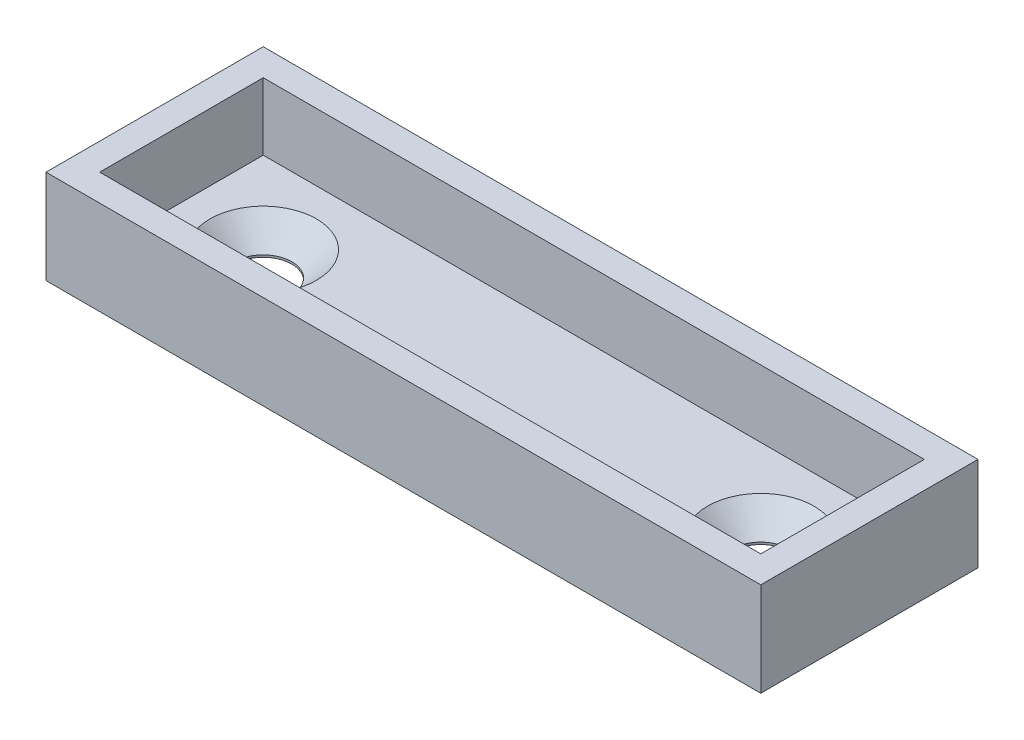
ISO-10303-21;
HEADER;
FILE_DESCRIPTION(('STEP AP214'),'2;1');
FILE_NAME('part.step','',(''),(''),'','','');
FILE_SCHEMA(('AUTOMOTIVE_DESIGN { 1 0 10303 214 1 1 1 1 }'));
ENDSEC;
DATA;
#1=APPLICATION_CONTEXT('core data for automotive mechanical design processes');
#2=APPLICATION_PROTOCOL_DEFINITION('international standard','automotive_design',2000,#1);
#3=PRODUCT_CONTEXT('',#1,'mechanical');
#4=PRODUCT('Part','Part','',(#3));
#5=PRODUCT_RELATED_PRODUCT_CATEGORY('part','',(#4));
#6=PRODUCT_DEFINITION_FORMATION('','',#4);
#7=PRODUCT_DEFINITION_CONTEXT('part definition',#1,'design');
#8=PRODUCT_DEFINITION('design','',#6,#7);
#9=PRODUCT_DEFINITION_SHAPE('','',#8);
#10=(LENGTH_UNIT() NAMED_UNIT(*) SI_UNIT(.MILLI.,.METRE.));
#11=(NAMED_UNIT(*) PLANE_ANGLE_UNIT() SI_UNIT($,.RADIAN.));
#12=(NAMED_UNIT(*) SI_UNIT($,.STERADIAN.) SOLID_ANGLE_UNIT());
#13=UNCERTAINTY_MEASURE_WITH_UNIT(LENGTH_MEASURE(1.E-05),#10,'distance_accuracy_value','');
#14=(GEOMETRIC_REPRESENTATION_CONTEXT(3) GLOBAL_UNCERTAINTY_ASSIGNED_CONTEXT((#13)) GLOBAL_UNIT_ASSIGNED_CONTEXT((#10,
#11,#12)) REPRESENTATION_CONTEXT('',''));
#15=CARTESIAN_POINT('',(0.,0.,0.));
#16=DIRECTION('',(0.,0.,1.));
#17=DIRECTION('',(1.,0.,0.));
#18=AXIS2_PLACEMENT_3D('',#15,#16,#17);
#19=CARTESIAN_POINT('',(18.542,0.,0.));
#20=DIRECTION('',(0.,1.,0.));
#21=DIRECTION('',(0.,0.,1.));
#22=AXIS2_PLACEMENT_3D('',#19,#20,#21);
#23=CYLINDRICAL_SURFACE('',#22,2.12725);
#24=CARTESIAN_POINT('',(18.542,0.,0.));
#25=DIRECTION('',(0.,-1.,0.));
#26=DIRECTION('',(0.,0.,1.));
#27=AXIS2_PLACEMENT_3D('',#24,#25,#26);
#28=CIRCLE('',#27,2.12725);
#29=CARTESIAN_POINT('',(18.542,0.,2.12725));
#30=VERTEX_POINT('',#29);
#31=EDGE_CURVE('E253',#30,#30,#28,.T.);
#32=ORIENTED_EDGE('',*,*,#31,.T.);
#33=EDGE_LOOP('',(#32));
#34=FACE_BOUND('',#33,.T.);
#35=CARTESIAN_POINT('',(18.542,0.158499999999956,0.));
#36=DIRECTION('',(0.,1.,0.));
#37=DIRECTION('',(-1.,0.,0.));
#38=AXIS2_PLACEMENT_3D('',#35,#36,#37);
#39=CIRCLE('',#38,2.12725);
#40=CARTESIAN_POINT('',(16.41475,0.158499999999971,0.));
#41=VERTEX_POINT('',#40);
#42=EDGE_CURVE('E45',#41,#41,#39,.T.);
#43=ORIENTED_EDGE('',*,*,#42,.T.);
#44=EDGE_LOOP('',(#43));
#45=FACE_BOUND('',#44,.T.);
#46=ADVANCED_FACE('F41',(#34,#45),#23,.F.);
#47=CARTESIAN_POINT('',(-18.542,0.,0.));
#48=DIRECTION('',(0.,1.,0.));
#49=DIRECTION('',(0.,0.,1.));
#50=AXIS2_PLACEMENT_3D('',#47,#48,#49);
#51=CYLINDRICAL_SURFACE('',#50,2.12725);
#52=CARTESIAN_POINT('',(-18.542,0.,0.));
#53=DIRECTION('',(0.,1.,0.));
#54=DIRECTION('',(0.,0.,1.));
#55=AXIS2_PLACEMENT_3D('',#52,#53,#54);
#56=CIRCLE('',#55,2.12725);
#57=CARTESIAN_POINT('',(-18.542,0.,2.12725));
#58=VERTEX_POINT('',#57);
#59=EDGE_CURVE('E262',#58,#58,#56,.T.);
#60=ORIENTED_EDGE('',*,*,#59,.F.);
#61=EDGE_LOOP('',(#60));
#62=FACE_BOUND('',#61,.T.);
#63=CARTESIAN_POINT('',(-18.542,0.158499999999956,0.));
#64=DIRECTION('',(0.,1.,0.));
#65=DIRECTION('',(-1.,0.,0.));
#66=AXIS2_PLACEMENT_3D('',#63,#64,#65);
#67=CIRCLE('',#66,2.12725);
#68=CARTESIAN_POINT('',(-20.66925,0.158499999999941,0.));
#69=VERTEX_POINT('',#68);
#70=EDGE_CURVE('E261',#69,#69,#67,.F.);
#71=ORIENTED_EDGE('',*,*,#70,.F.);
#72=EDGE_LOOP('',(#71));
#73=FACE_BOUND('',#72,.T.);
#74=ADVANCED_FACE('F353',(#62,#73),#51,.F.);
#75=CARTESIAN_POINT('',(0.,2.,0.));
#76=DIRECTION('',(0.,-1.,0.));
#77=DIRECTION('',(0.,0.,-1.));
#78=AXIS2_PLACEMENT_3D('',#75,#76,#77);
#79=PLANE('',#78);
#80=CARTESIAN_POINT('',(18.542,1.99999999999997,0.));
#81=DIRECTION('',(0.,1.,0.));
#82=DIRECTION('',(-1.,0.,0.));
#83=AXIS2_PLACEMENT_3D('',#80,#81,#82);
#84=CIRCLE('',#83,3.96874999999999);
#85=CARTESIAN_POINT('',(14.57325,2.,0.));
#86=VERTEX_POINT('',#85);
#87=EDGE_CURVE('E203',#86,#86,#84,.T.);
#88=ORIENTED_EDGE('',*,*,#87,.F.);
#89=EDGE_LOOP('',(#88));
#90=FACE_BOUND('',#89,.T.);
#91=CARTESIAN_POINT('',(-18.542,1.99999999999997,0.));
#92=DIRECTION('',(0.,-1.,0.));
#93=DIRECTION('',(1.,0.,0.));
#94=AXIS2_PLACEMENT_3D('',#91,#92,#93);
#95=CIRCLE('',#94,3.96874999999999);
#96=CARTESIAN_POINT('',(-14.57325,2.,0.));
#97=VERTEX_POINT('',#96);
#98=EDGE_CURVE('E257',#97,#97,#95,.T.);
#99=ORIENTED_EDGE('',*,*,#98,.T.);
#100=EDGE_LOOP('',(#99));
#101=FACE_BOUND('',#100,.T.);
#102=DIRECTION('',(0.,0.,-1.));
#103=VECTOR('',#102,1.);
#104=CARTESIAN_POINT('',(24.638,2.,6.096));
#105=LINE('',#104,#103);
#106=CARTESIAN_POINT('',(24.638,2.,6.096));
#107=VERTEX_POINT('',#106);
#108=CARTESIAN_POINT('',(24.638,2.,-6.096));
#109=VERTEX_POINT('',#108);
#110=EDGE_CURVE('E335',#107,#109,#105,.T.);
#111=ORIENTED_EDGE('',*,*,#110,.T.);
#112=DIRECTION('',(-1.,0.,0.));
#113=VECTOR('',#112,1.);
#114=CARTESIAN_POINT('',(-24.638,2.,-6.096));
#115=LINE('',#114,#113);
#116=CARTESIAN_POINT('',(-24.638,2.,-6.096));
#117=VERTEX_POINT('',#116);
#118=EDGE_CURVE('E341',#109,#117,#115,.T.);
#119=ORIENTED_EDGE('',*,*,#118,.T.);
#120=DIRECTION('',(0.,0.,1.));
#121=VECTOR('',#120,1.);
#122=CARTESIAN_POINT('',(-24.638,2.,6.096));
#123=LINE('',#122,#121);
#124=CARTESIAN_POINT('',(-24.638,2.,6.096));
#125=VERTEX_POINT('',#124);
#126=EDGE_CURVE('E51',#117,#125,#123,.T.);
#127=ORIENTED_EDGE('',*,*,#126,.T.);
#128=DIRECTION('',(1.,0.,0.));
#129=VECTOR('',#128,1.);
#130=CARTESIAN_POINT('',(-24.638,2.,6.096));
#131=LINE('',#130,#129);
#132=EDGE_CURVE('E12',#125,#107,#131,.T.);
#133=ORIENTED_EDGE('',*,*,#132,.T.);
#134=EDGE_LOOP('',(#111,#119,#127,#133));
#135=FACE_BOUND('',#134,.T.);
#136=ADVANCED_FACE('F355',(#90,#101,#135),#79,.F.);
#137=CARTESIAN_POINT('',(-24.638,67.682250672903,6.096));
#138=DIRECTION('',(0.,0.,-1.));
#139=DIRECTION('',(-1.,0.,0.));
#140=AXIS2_PLACEMENT_3D('',#137,#138,#139);
#141=PLANE('',#140);
#142=ORIENTED_EDGE('',*,*,#132,.F.);
#143=DIRECTION('',(0.,-1.,0.));
#144=VECTOR('',#143,1.);
#145=CARTESIAN_POINT('',(-24.638,67.682250672903,6.096));
#146=LINE('',#145,#144);
#147=CARTESIAN_POINT('',(-24.638,7.,6.096));
#148=VERTEX_POINT('',#147);
#149=EDGE_CURVE('E315',#148,#125,#146,.T.);
#150=ORIENTED_EDGE('',*,*,#149,.F.);
#151=DIRECTION('',(-1.,0.,0.));
#152=VECTOR('',#151,1.);
#153=CARTESIAN_POINT('',(-24.638,7.,6.096));
#154=LINE('',#153,#152);
#155=CARTESIAN_POINT('',(24.638,7.,6.096));
#156=VERTEX_POINT('',#155);
#157=EDGE_CURVE('E295',#156,#148,#154,.T.);
#158=ORIENTED_EDGE('',*,*,#157,.F.);
#159=DIRECTION('',(0.,-1.,0.));
#160=VECTOR('',#159,1.);
#161=CARTESIAN_POINT('',(24.638,67.682250672903,6.096));
#162=LINE('',#161,#160);
#163=EDGE_CURVE('E271',#156,#107,#162,.T.);
#164=ORIENTED_EDGE('',*,*,#163,.T.);
#165=EDGE_LOOP('',(#142,#150,#158,#164));
#166=FACE_BOUND('',#165,.T.);
#167=ADVANCED_FACE('F362',(#166),#141,.T.);
#168=CARTESIAN_POINT('',(24.638,67.682250672903,6.096));
#169=DIRECTION('',(-1.,0.,0.));
#170=DIRECTION('',(0.,0.,1.));
#171=AXIS2_PLACEMENT_3D('',#168,#169,#170);
#172=PLANE('',#171);
#173=ORIENTED_EDGE('',*,*,#110,.F.);
#174=ORIENTED_EDGE('',*,*,#163,.F.);
#175=DIRECTION('',(0.,0.,1.));
#176=VECTOR('',#175,1.);
#177=CARTESIAN_POINT('',(24.638,7.,6.096));
#178=LINE('',#177,#176);
#179=CARTESIAN_POINT('',(24.638,7.,-6.096));
#180=VERTEX_POINT('',#179);
#181=EDGE_CURVE('E332',#180,#156,#178,.T.);
#182=ORIENTED_EDGE('',*,*,#181,.F.);
#183=DIRECTION('',(0.,-1.,0.));
#184=VECTOR('',#183,1.);
#185=CARTESIAN_POINT('',(24.638,67.682250672903,-6.096));
#186=LINE('',#185,#184);
#187=EDGE_CURVE('E307',#180,#109,#186,.T.);
#188=ORIENTED_EDGE('',*,*,#187,.T.);
#189=EDGE_LOOP('',(#173,#174,#182,#188));
#190=FACE_BOUND('',#189,.T.);
#191=ADVANCED_FACE('F393',(#190),#172,.T.);
#192=CARTESIAN_POINT('',(24.638,67.682250672903,-6.096));
#193=DIRECTION('',(0.,0.,1.));
#194=DIRECTION('',(1.,0.,0.));
#195=AXIS2_PLACEMENT_3D('',#192,#193,#194);
#196=PLANE('',#195);
#197=ORIENTED_EDGE('',*,*,#118,.F.);
#198=ORIENTED_EDGE('',*,*,#187,.F.);
#199=DIRECTION('',(1.,0.,0.));
#200=VECTOR('',#199,1.);
#201=CARTESIAN_POINT('',(24.638,7.,-6.096));
#202=LINE('',#201,#200);
#203=CARTESIAN_POINT('',(-24.638,7.,-6.096));
#204=VERTEX_POINT('',#203);
#205=EDGE_CURVE('E294',#204,#180,#202,.T.);
#206=ORIENTED_EDGE('',*,*,#205,.F.);
#207=DIRECTION('',(0.,-1.,0.));
#208=VECTOR('',#207,1.);
#209=CARTESIAN_POINT('',(-24.638,67.682250672903,-6.096));
#210=LINE('',#209,#208);
#211=EDGE_CURVE('E311',#204,#117,#210,.T.);
#212=ORIENTED_EDGE('',*,*,#211,.T.);
#213=EDGE_LOOP('',(#197,#198,#206,#212));
#214=FACE_BOUND('',#213,.T.);
#215=ADVANCED_FACE('F389',(#214),#196,.T.);
#216=CARTESIAN_POINT('',(-24.638,67.682250672903,-6.096));
#217=DIRECTION('',(1.,0.,0.));
#218=DIRECTION('',(0.,0.,-1.));
#219=AXIS2_PLACEMENT_3D('',#216,#217,#218);
#220=PLANE('',#219);
#221=ORIENTED_EDGE('',*,*,#126,.F.);
#222=ORIENTED_EDGE('',*,*,#211,.F.);
#223=DIRECTION('',(0.,0.,-1.));
#224=VECTOR('',#223,1.);
#225=CARTESIAN_POINT('',(-24.638,7.,-6.096));
#226=LINE('',#225,#224);
#227=EDGE_CURVE('E291',#148,#204,#226,.T.);
#228=ORIENTED_EDGE('',*,*,#227,.F.);
#229=ORIENTED_EDGE('',*,*,#149,.T.);
#230=EDGE_LOOP('',(#221,#222,#228,#229));
#231=FACE_BOUND('',#230,.T.);
#232=ADVANCED_FACE('F385',(#231),#220,.T.);
#233=CARTESIAN_POINT('',(26.638,67.682250672903,8.096));
#234=DIRECTION('',(-1.,0.,0.));
#235=DIRECTION('',(0.,0.,1.));
#236=AXIS2_PLACEMENT_3D('',#233,#234,#235);
#237=PLANE('',#236);
#238=DIRECTION('',(0.,-1.,0.));
#239=VECTOR('',#238,1.);
#240=CARTESIAN_POINT('',(26.638,67.682250672903,-8.096));
#241=LINE('',#240,#239);
#242=CARTESIAN_POINT('',(26.638,7.,-8.096));
#243=VERTEX_POINT('',#242);
#244=CARTESIAN_POINT('',(26.638,0.,-8.096));
#245=VERTEX_POINT('',#244);
#246=EDGE_CURVE('E284',#243,#245,#241,.T.);
#247=ORIENTED_EDGE('',*,*,#246,.F.);
#248=DIRECTION('',(0.,0.,1.));
#249=VECTOR('',#248,1.);
#250=CARTESIAN_POINT('',(26.638,7.,8.096));
#251=LINE('',#250,#249);
#252=CARTESIAN_POINT('',(26.638,7.,8.096));
#253=VERTEX_POINT('',#252);
#254=EDGE_CURVE('E266',#243,#253,#251,.T.);
#255=ORIENTED_EDGE('',*,*,#254,.T.);
#256=DIRECTION('',(0.,-1.,0.));
#257=VECTOR('',#256,1.);
#258=CARTESIAN_POINT('',(26.638,67.682250672903,8.096));
#259=LINE('',#258,#257);
#260=CARTESIAN_POINT('',(26.638,0.,8.096));
#261=VERTEX_POINT('',#260);
#262=EDGE_CURVE('E290',#253,#261,#259,.T.);
#263=ORIENTED_EDGE('',*,*,#262,.T.);
#264=DIRECTION('',(0.,0.,-1.));
#265=VECTOR('',#264,1.);
#266=CARTESIAN_POINT('',(26.638,0.,8.096));
#267=LINE('',#266,#265);
#268=EDGE_CURVE('E285',#261,#245,#267,.T.);
#269=ORIENTED_EDGE('',*,*,#268,.T.);
#270=EDGE_LOOP('',(#247,#255,#263,#269));
#271=FACE_BOUND('',#270,.T.);
#272=ADVANCED_FACE('F381',(#271),#237,.F.);
#273=CARTESIAN_POINT('',(-26.638,67.682250672903,-8.096));
#274=DIRECTION('',(0.,0.,1.));
#275=DIRECTION('',(1.,0.,0.));
#276=AXIS2_PLACEMENT_3D('',#273,#274,#275);
#277=PLANE('',#276);
#278=DIRECTION('',(0.,-1.,0.));
#279=VECTOR('',#278,1.);
#280=CARTESIAN_POINT('',(-26.638,67.682250672903,-8.096));
#281=LINE('',#280,#279);
#282=CARTESIAN_POINT('',(-26.638,7.,-8.096));
#283=VERTEX_POINT('',#282);
#284=CARTESIAN_POINT('',(-26.638,0.,-8.096));
#285=VERTEX_POINT('',#284);
#286=EDGE_CURVE('E278',#283,#285,#281,.T.);
#287=ORIENTED_EDGE('',*,*,#286,.F.);
#288=DIRECTION('',(1.,0.,0.));
#289=VECTOR('',#288,1.);
#290=CARTESIAN_POINT('',(-26.638,7.,-8.096));
#291=LINE('',#290,#289);
#292=EDGE_CURVE('E289',#283,#243,#291,.T.);
#293=ORIENTED_EDGE('',*,*,#292,.T.);
#294=ORIENTED_EDGE('',*,*,#246,.T.);
#295=DIRECTION('',(-1.,0.,0.));
#296=VECTOR('',#295,1.);
#297=CARTESIAN_POINT('',(-26.638,0.,-8.096));
#298=LINE('',#297,#296);
#299=EDGE_CURVE('E279',#245,#285,#298,.T.);
#300=ORIENTED_EDGE('',*,*,#299,.T.);
#301=EDGE_LOOP('',(#287,#293,#294,#300));
#302=FACE_BOUND('',#301,.T.);
#303=ADVANCED_FACE('F377',(#302),#277,.F.);
#304=CARTESIAN_POINT('',(-26.638,67.682250672903,8.096));
#305=DIRECTION('',(1.,0.,0.));
#306=DIRECTION('',(0.,0.,-1.));
#307=AXIS2_PLACEMENT_3D('',#304,#305,#306);
#308=PLANE('',#307);
#309=DIRECTION('',(0.,-1.,0.));
#310=VECTOR('',#309,1.);
#311=CARTESIAN_POINT('',(-26.638,67.682250672903,8.096));
#312=LINE('',#311,#310);
#313=CARTESIAN_POINT('',(-26.638,7.,8.096));
#314=VERTEX_POINT('',#313);
#315=CARTESIAN_POINT('',(-26.638,0.,8.096));
#316=VERTEX_POINT('',#315);
#317=EDGE_CURVE('E272',#314,#316,#312,.T.);
#318=ORIENTED_EDGE('',*,*,#317,.F.);
#319=DIRECTION('',(0.,0.,-1.));
#320=VECTOR('',#319,1.);
#321=CARTESIAN_POINT('',(-26.638,7.,8.096));
#322=LINE('',#321,#320);
#323=EDGE_CURVE('E283',#314,#283,#322,.T.);
#324=ORIENTED_EDGE('',*,*,#323,.T.);
#325=ORIENTED_EDGE('',*,*,#286,.T.);
#326=DIRECTION('',(0.,0.,1.));
#327=VECTOR('',#326,1.);
#328=CARTESIAN_POINT('',(-26.638,0.,8.096));
#329=LINE('',#328,#327);
#330=EDGE_CURVE('E273',#285,#316,#329,.T.);
#331=ORIENTED_EDGE('',*,*,#330,.T.);
#332=EDGE_LOOP('',(#318,#324,#325,#331));
#333=FACE_BOUND('',#332,.T.);
#334=ADVANCED_FACE('F373',(#333),#308,.F.);
#335=CARTESIAN_POINT('',(-26.638,67.682250672903,8.096));
#336=DIRECTION('',(0.,0.,-1.));
#337=DIRECTION('',(-1.,0.,0.));
#338=AXIS2_PLACEMENT_3D('',#335,#336,#337);
#339=PLANE('',#338);
#340=ORIENTED_EDGE('',*,*,#262,.F.);
#341=DIRECTION('',(-1.,0.,0.));
#342=VECTOR('',#341,1.);
#343=CARTESIAN_POINT('',(-26.638,7.,8.096));
#344=LINE('',#343,#342);
#345=EDGE_CURVE('E277',#253,#314,#344,.T.);
#346=ORIENTED_EDGE('',*,*,#345,.T.);
#347=ORIENTED_EDGE('',*,*,#317,.T.);
#348=DIRECTION('',(1.,0.,0.));
#349=VECTOR('',#348,1.);
#350=CARTESIAN_POINT('',(-26.638,0.,8.096));
#351=LINE('',#350,#349);
#352=EDGE_CURVE('E267',#316,#261,#351,.T.);
#353=ORIENTED_EDGE('',*,*,#352,.T.);
#354=EDGE_LOOP('',(#340,#346,#347,#353));
#355=FACE_BOUND('',#354,.T.);
#356=ADVANCED_FACE('F369',(#355),#339,.F.);
#357=CARTESIAN_POINT('',(0.,7.,0.));
#358=DIRECTION('',(0.,-1.,0.));
#359=DIRECTION('',(0.,0.,-1.));
#360=AXIS2_PLACEMENT_3D('',#357,#358,#359);
#361=PLANE('',#360);
#362=ORIENTED_EDGE('',*,*,#157,.T.);
#363=ORIENTED_EDGE('',*,*,#227,.T.);
#364=ORIENTED_EDGE('',*,*,#205,.T.);
#365=ORIENTED_EDGE('',*,*,#181,.T.);
#366=EDGE_LOOP('',(#362,#363,#364,#365));
#367=FACE_BOUND('',#366,.T.);
#368=ORIENTED_EDGE('',*,*,#292,.F.);
#369=ORIENTED_EDGE('',*,*,#323,.F.);
#370=ORIENTED_EDGE('',*,*,#345,.F.);
#371=ORIENTED_EDGE('',*,*,#254,.F.);
#372=EDGE_LOOP('',(#368,#369,#370,#371));
#373=FACE_BOUND('',#372,.T.);
#374=ADVANCED_FACE('F372',(#367,#373),#361,.F.);
#375=CARTESIAN_POINT('',(0.,0.,0.));
#376=DIRECTION('',(0.,-1.,0.));
#377=DIRECTION('',(0.,0.,-1.));
#378=AXIS2_PLACEMENT_3D('',#375,#376,#377);
#379=PLANE('',#378);
#380=DIRECTION('',(0.,0.,1.));
#381=VECTOR('',#380,1.);
#382=CARTESIAN_POINT('',(12.5,0.,3.846));
#383=LINE('',#382,#381);
#384=CARTESIAN_POINT('',(12.5,0.,3.846));
#385=VERTEX_POINT('',#384);
#386=CARTESIAN_POINT('',(12.5,0.,7.096));
#387=VERTEX_POINT('',#386);
#388=EDGE_CURVE('E59',#385,#387,#383,.T.);
#389=ORIENTED_EDGE('',*,*,#388,.F.);
#390=DIRECTION('',(1.,0.,0.));
#391=VECTOR('',#390,1.);
#392=CARTESIAN_POINT('',(-12.5,0.,3.846));
#393=LINE('',#392,#391);
#394=CARTESIAN_POINT('',(-12.5,0.,3.846));
#395=VERTEX_POINT('',#394);
#396=EDGE_CURVE('E180',#395,#385,#393,.T.);
#397=ORIENTED_EDGE('',*,*,#396,.F.);
#398=DIRECTION('',(0.,0.,-1.));
#399=VECTOR('',#398,1.);
#400=CARTESIAN_POINT('',(-12.5,0.,3.846));
#401=LINE('',#400,#399);
#402=CARTESIAN_POINT('',(-12.5,0.,7.096));
#403=VERTEX_POINT('',#402);
#404=EDGE_CURVE('E184',#403,#395,#401,.T.);
#405=ORIENTED_EDGE('',*,*,#404,.F.);
#406=DIRECTION('',(-1.,0.,0.));
#407=VECTOR('',#406,1.);
#408=CARTESIAN_POINT('',(-12.5,0.,7.096));
#409=LINE('',#408,#407);
#410=EDGE_CURVE('E193',#387,#403,#409,.T.);
#411=ORIENTED_EDGE('',*,*,#410,.F.);
#412=EDGE_LOOP('',(#389,#397,#405,#411));
#413=FACE_BOUND('',#412,.T.);
#414=DIRECTION('',(0.,0.,1.));
#415=VECTOR('',#414,1.);
#416=CARTESIAN_POINT('',(12.5,0.,-7.096));
#417=LINE('',#416,#415);
#418=CARTESIAN_POINT('',(12.5,0.,-7.096));
#419=VERTEX_POINT('',#418);
#420=CARTESIAN_POINT('',(12.5,0.,-3.846));
#421=VERTEX_POINT('',#420);
#422=EDGE_CURVE('E67',#419,#421,#417,.T.);
#423=ORIENTED_EDGE('',*,*,#422,.F.);
#424=DIRECTION('',(1.,0.,0.));
#425=VECTOR('',#424,1.);
#426=CARTESIAN_POINT('',(-12.5,0.,-7.096));
#427=LINE('',#426,#425);
#428=CARTESIAN_POINT('',(-12.5,0.,-7.096));
#429=VERTEX_POINT('',#428);
#430=EDGE_CURVE('E214',#429,#419,#427,.T.);
#431=ORIENTED_EDGE('',*,*,#430,.F.);
#432=DIRECTION('',(0.,0.,-1.));
#433=VECTOR('',#432,1.);
#434=CARTESIAN_POINT('',(-12.5,0.,-7.096));
#435=LINE('',#434,#433);
#436=CARTESIAN_POINT('',(-12.5,0.,-3.846));
#437=VERTEX_POINT('',#436);
#438=EDGE_CURVE('E233',#437,#429,#435,.T.);
#439=ORIENTED_EDGE('',*,*,#438,.F.);
#440=DIRECTION('',(-1.,0.,0.));
#441=VECTOR('',#440,1.);
#442=CARTESIAN_POINT('',(-12.5,0.,-3.846));
#443=LINE('',#442,#441);
#444=EDGE_CURVE('E229',#421,#437,#443,.T.);
#445=ORIENTED_EDGE('',*,*,#444,.F.);
#446=EDGE_LOOP('',(#423,#431,#439,#445));
#447=FACE_BOUND('',#446,.T.);
#448=ORIENTED_EDGE('',*,*,#31,.F.);
#449=EDGE_LOOP('',(#448));
#450=FACE_BOUND('',#449,.T.);
#451=ORIENTED_EDGE('',*,*,#59,.T.);
#452=EDGE_LOOP('',(#451));
#453=FACE_BOUND('',#452,.T.);
#454=ORIENTED_EDGE('',*,*,#268,.F.);
#455=ORIENTED_EDGE('',*,*,#352,.F.);
#456=ORIENTED_EDGE('',*,*,#330,.F.);
#457=ORIENTED_EDGE('',*,*,#299,.F.);
#458=EDGE_LOOP('',(#454,#455,#456,#457));
#459=FACE_BOUND('',#458,.T.);
#460=ADVANCED_FACE('F43',(#413,#447,#450,#453,#459),#379,.T.);
#461=CARTESIAN_POINT('',(-18.542,1.99999999999997,0.));
#462=DIRECTION('',(0.,1.,0.));
#463=DIRECTION('',(-1.,0.,0.));
#464=AXIS2_PLACEMENT_3D('',#461,#462,#463);
#465=CONICAL_SURFACE('',#464,3.96874999999999,0.785398163397441);
#466=ORIENTED_EDGE('',*,*,#98,.F.);
#467=EDGE_LOOP('',(#466));
#468=FACE_BOUND('',#467,.T.);
#469=ORIENTED_EDGE('',*,*,#70,.T.);
#470=EDGE_LOOP('',(#469));
#471=FACE_BOUND('',#470,.T.);
#472=ADVANCED_FACE('F351',(#468,#471),#465,.F.);
#473=CARTESIAN_POINT('',(18.542,1.99999999999997,0.));
#474=DIRECTION('',(0.,1.,0.));
#475=DIRECTION('',(1.,0.,0.));
#476=AXIS2_PLACEMENT_3D('',#473,#474,#475);
#477=CONICAL_SURFACE('',#476,3.96874999999999,0.785398163397441);
#478=ORIENTED_EDGE('',*,*,#42,.F.);
#479=EDGE_LOOP('',(#478));
#480=FACE_BOUND('',#479,.T.);
#481=ORIENTED_EDGE('',*,*,#87,.T.);
#482=EDGE_LOOP('',(#481));
#483=FACE_BOUND('',#482,.T.);
#484=ADVANCED_FACE('F430',(#480,#483),#477,.F.);
#485=CARTESIAN_POINT('',(12.5,0.6,-7.096));
#486=DIRECTION('',(1.,0.,0.));
#487=DIRECTION('',(0.,0.,-1.));
#488=AXIS2_PLACEMENT_3D('',#485,#486,#487);
#489=PLANE('',#488);
#490=ORIENTED_EDGE('',*,*,#422,.T.);
#491=DIRECTION('',(0.,-1.,0.));
#492=VECTOR('',#491,1.);
#493=CARTESIAN_POINT('',(12.5,0.6,-3.846));
#494=LINE('',#493,#492);
#495=CARTESIAN_POINT('',(12.5,0.6,-3.846));
#496=VERTEX_POINT('',#495);
#497=EDGE_CURVE('E226',#496,#421,#494,.T.);
#498=ORIENTED_EDGE('',*,*,#497,.F.);
#499=DIRECTION('',(0.,0.,1.));
#500=VECTOR('',#499,1.);
#501=CARTESIAN_POINT('',(12.5,0.6,-7.096));
#502=LINE('',#501,#500);
#503=CARTESIAN_POINT('',(12.5,0.6,-7.096));
#504=VERTEX_POINT('',#503);
#505=EDGE_CURVE('E209',#504,#496,#502,.T.);
#506=ORIENTED_EDGE('',*,*,#505,.F.);
#507=DIRECTION('',(0.,-1.,0.));
#508=VECTOR('',#507,1.);
#509=CARTESIAN_POINT('',(12.5,0.6,-7.096));
#510=LINE('',#509,#508);
#511=EDGE_CURVE('E194',#504,#419,#510,.T.);
#512=ORIENTED_EDGE('',*,*,#511,.T.);
#513=EDGE_LOOP('',(#490,#498,#506,#512));
#514=FACE_BOUND('',#513,.T.);
#515=ADVANCED_FACE('F446',(#514),#489,.F.);
#516=CARTESIAN_POINT('',(-12.5,0.6,-7.096));
#517=DIRECTION('',(0.,0.,-1.));
#518=DIRECTION('',(-1.,0.,0.));
#519=AXIS2_PLACEMENT_3D('',#516,#517,#518);
#520=PLANE('',#519);
#521=ORIENTED_EDGE('',*,*,#430,.T.);
#522=ORIENTED_EDGE('',*,*,#511,.F.);
#523=DIRECTION('',(1.,0.,0.));
#524=VECTOR('',#523,1.);
#525=CARTESIAN_POINT('',(-12.5,0.6,-7.096));
#526=LINE('',#525,#524);
#527=CARTESIAN_POINT('',(-12.5,0.6,-7.096));
#528=VERTEX_POINT('',#527);
#529=EDGE_CURVE('E222',#528,#504,#526,.T.);
#530=ORIENTED_EDGE('',*,*,#529,.F.);
#531=DIRECTION('',(0.,-1.,0.));
#532=VECTOR('',#531,1.);
#533=CARTESIAN_POINT('',(-12.5,0.6,-7.096));
#534=LINE('',#533,#532);
#535=EDGE_CURVE('E242',#528,#429,#534,.T.);
#536=ORIENTED_EDGE('',*,*,#535,.T.);
#537=EDGE_LOOP('',(#521,#522,#530,#536));
#538=FACE_BOUND('',#537,.T.);
#539=ADVANCED_FACE('F454',(#538),#520,.F.);
#540=CARTESIAN_POINT('',(-12.5,0.6,-7.096));
#541=DIRECTION('',(-1.,0.,0.));
#542=DIRECTION('',(0.,0.,1.));
#543=AXIS2_PLACEMENT_3D('',#540,#541,#542);
#544=PLANE('',#543);
#545=ORIENTED_EDGE('',*,*,#438,.T.);
#546=ORIENTED_EDGE('',*,*,#535,.F.);
#547=DIRECTION('',(0.,0.,-1.));
#548=VECTOR('',#547,1.);
#549=CARTESIAN_POINT('',(-12.5,0.6,-7.096));
#550=LINE('',#549,#548);
#551=CARTESIAN_POINT('',(-12.5,0.6,-3.846));
#552=VERTEX_POINT('',#551);
#553=EDGE_CURVE('E218',#552,#528,#550,.T.);
#554=ORIENTED_EDGE('',*,*,#553,.F.);
#555=DIRECTION('',(0.,-1.,0.));
#556=VECTOR('',#555,1.);
#557=CARTESIAN_POINT('',(-12.5,0.6,-3.846));
#558=LINE('',#557,#556);
#559=EDGE_CURVE('E245',#552,#437,#558,.T.);
#560=ORIENTED_EDGE('',*,*,#559,.T.);
#561=EDGE_LOOP('',(#545,#546,#554,#560));
#562=FACE_BOUND('',#561,.T.);
#563=ADVANCED_FACE('F461',(#562),#544,.F.);
#564=CARTESIAN_POINT('',(-12.5,0.6,-3.846));
#565=DIRECTION('',(0.,0.,1.));
#566=DIRECTION('',(1.,0.,0.));
#567=AXIS2_PLACEMENT_3D('',#564,#565,#566);
#568=PLANE('',#567);
#569=ORIENTED_EDGE('',*,*,#444,.T.);
#570=ORIENTED_EDGE('',*,*,#559,.F.);
#571=DIRECTION('',(-1.,0.,0.));
#572=VECTOR('',#571,1.);
#573=CARTESIAN_POINT('',(-12.5,0.6,-3.846));
#574=LINE('',#573,#572);
#575=EDGE_CURVE('E213',#496,#552,#574,.T.);
#576=ORIENTED_EDGE('',*,*,#575,.F.);
#577=ORIENTED_EDGE('',*,*,#497,.T.);
#578=EDGE_LOOP('',(#569,#570,#576,#577));
#579=FACE_BOUND('',#578,.T.);
#580=ADVANCED_FACE('F457',(#579),#568,.F.);
#581=CARTESIAN_POINT('',(0.,0.6,0.));
#582=DIRECTION('',(0.,1.,0.));
#583=DIRECTION('',(0.,0.,1.));
#584=AXIS2_PLACEMENT_3D('',#581,#582,#583);
#585=PLANE('',#584);
#586=ORIENTED_EDGE('',*,*,#505,.T.);
#587=ORIENTED_EDGE('',*,*,#575,.T.);
#588=ORIENTED_EDGE('',*,*,#553,.T.);
#589=ORIENTED_EDGE('',*,*,#529,.T.);
#590=EDGE_LOOP('',(#586,#587,#588,#589));
#591=FACE_BOUND('',#590,.T.);
#592=ADVANCED_FACE('F460',(#591),#585,.F.);
#593=CARTESIAN_POINT('',(12.5,0.6,3.846));
#594=DIRECTION('',(1.,0.,0.));
#595=DIRECTION('',(0.,0.,-1.));
#596=AXIS2_PLACEMENT_3D('',#593,#594,#595);
#597=PLANE('',#596);
#598=ORIENTED_EDGE('',*,*,#388,.T.);
#599=DIRECTION('',(0.,-1.,0.));
#600=VECTOR('',#599,1.);
#601=CARTESIAN_POINT('',(12.5,0.6,7.096));
#602=LINE('',#601,#600);
#603=CARTESIAN_POINT('',(12.5,0.6,7.096));
#604=VERTEX_POINT('',#603);
#605=EDGE_CURVE('E155',#604,#387,#602,.T.);
#606=ORIENTED_EDGE('',*,*,#605,.F.);
#607=DIRECTION('',(0.,0.,1.));
#608=VECTOR('',#607,1.);
#609=CARTESIAN_POINT('',(12.5,0.6,3.846));
#610=LINE('',#609,#608);
#611=CARTESIAN_POINT('',(12.5,0.6,3.846));
#612=VERTEX_POINT('',#611);
#613=EDGE_CURVE('E159',#612,#604,#610,.T.);
#614=ORIENTED_EDGE('',*,*,#613,.F.);
#615=DIRECTION('',(0.,-1.,0.));
#616=VECTOR('',#615,1.);
#617=CARTESIAN_POINT('',(12.5,0.6,3.846));
#618=LINE('',#617,#616);
#619=EDGE_CURVE('E200',#612,#385,#618,.T.);
#620=ORIENTED_EDGE('',*,*,#619,.T.);
#621=EDGE_LOOP('',(#598,#606,#614,#620));
#622=FACE_BOUND('',#621,.T.);
#623=ADVANCED_FACE('F157',(#622),#597,.F.);
#624=CARTESIAN_POINT('',(-12.5,0.6,3.846));
#625=DIRECTION('',(0.,0.,-1.));
#626=DIRECTION('',(-1.,0.,0.));
#627=AXIS2_PLACEMENT_3D('',#624,#625,#626);
#628=PLANE('',#627);
#629=ORIENTED_EDGE('',*,*,#396,.T.);
#630=ORIENTED_EDGE('',*,*,#619,.F.);
#631=DIRECTION('',(1.,0.,0.));
#632=VECTOR('',#631,1.);
#633=CARTESIAN_POINT('',(-12.5,0.6,3.846));
#634=LINE('',#633,#632);
#635=CARTESIAN_POINT('',(-12.5,0.6,3.846));
#636=VERTEX_POINT('',#635);
#637=EDGE_CURVE('E166',#636,#612,#634,.T.);
#638=ORIENTED_EDGE('',*,*,#637,.F.);
#639=DIRECTION('',(0.,-1.,0.));
#640=VECTOR('',#639,1.);
#641=CARTESIAN_POINT('',(-12.5,0.6,3.846));
#642=LINE('',#641,#640);
#643=EDGE_CURVE('E204',#636,#395,#642,.T.);
#644=ORIENTED_EDGE('',*,*,#643,.T.);
#645=EDGE_LOOP('',(#629,#630,#638,#644));
#646=FACE_BOUND('',#645,.T.);
#647=ADVANCED_FACE('F474',(#646),#628,.F.);
#648=CARTESIAN_POINT('',(-12.5,0.6,3.846));
#649=DIRECTION('',(-1.,0.,0.));
#650=DIRECTION('',(0.,0.,1.));
#651=AXIS2_PLACEMENT_3D('',#648,#649,#650);
#652=PLANE('',#651);
#653=ORIENTED_EDGE('',*,*,#404,.T.);
#654=ORIENTED_EDGE('',*,*,#643,.F.);
#655=DIRECTION('',(0.,0.,-1.));
#656=VECTOR('',#655,1.);
#657=CARTESIAN_POINT('',(-12.5,0.6,3.846));
#658=LINE('',#657,#656);
#659=CARTESIAN_POINT('',(-12.5,0.6,7.096));
#660=VERTEX_POINT('',#659);
#661=EDGE_CURVE('E175',#660,#636,#658,.T.);
#662=ORIENTED_EDGE('',*,*,#661,.F.);
#663=DIRECTION('',(0.,-1.,0.));
#664=VECTOR('',#663,1.);
#665=CARTESIAN_POINT('',(-12.5,0.6,7.096));
#666=LINE('',#665,#664);
#667=EDGE_CURVE('E165',#660,#403,#666,.T.);
#668=ORIENTED_EDGE('',*,*,#667,.T.);
#669=EDGE_LOOP('',(#653,#654,#662,#668));
#670=FACE_BOUND('',#669,.T.);
#671=ADVANCED_FACE('F477',(#670),#652,.F.);
#672=CARTESIAN_POINT('',(-12.5,0.6,7.096));
#673=DIRECTION('',(0.,0.,1.));
#674=DIRECTION('',(1.,0.,0.));
#675=AXIS2_PLACEMENT_3D('',#672,#673,#674);
#676=PLANE('',#675);
#677=ORIENTED_EDGE('',*,*,#410,.T.);
#678=ORIENTED_EDGE('',*,*,#667,.F.);
#679=DIRECTION('',(-1.,0.,0.));
#680=VECTOR('',#679,1.);
#681=CARTESIAN_POINT('',(-12.5,0.6,7.096));
#682=LINE('',#681,#680);
#683=EDGE_CURVE('E169',#604,#660,#682,.T.);
#684=ORIENTED_EDGE('',*,*,#683,.F.);
#685=ORIENTED_EDGE('',*,*,#605,.T.);
#686=EDGE_LOOP('',(#677,#678,#684,#685));
#687=FACE_BOUND('',#686,.T.);
#688=ADVANCED_FACE('F170',(#687),#676,.F.);
#689=CARTESIAN_POINT('',(0.,0.6,0.));
#690=DIRECTION('',(0.,1.,0.));
#691=DIRECTION('',(0.,0.,1.));
#692=AXIS2_PLACEMENT_3D('',#689,#690,#691);
#693=PLANE('',#692);
#694=ORIENTED_EDGE('',*,*,#613,.T.);
#695=ORIENTED_EDGE('',*,*,#683,.T.);
#696=ORIENTED_EDGE('',*,*,#661,.T.);
#697=ORIENTED_EDGE('',*,*,#637,.T.);
#698=EDGE_LOOP('',(#694,#695,#696,#697));
#699=FACE_BOUND('',#698,.T.);
#700=ADVANCED_FACE('F177',(#699),#693,.F.);
#701=CLOSED_SHELL('',(#46,#74,#136,#167,#191,#215,#232,#272,#303,#334,#356,#374,#460,#472,#484,
#515,#539,#563,#580,#592,#623,#647,#671,#688,#700));
#702=MANIFOLD_SOLID_BREP('B2',#701);
#703=ADVANCED_BREP_SHAPE_REPRESENTATION('',(#18,#702),#14);
#704=SHAPE_DEFINITION_REPRESENTATION(#9,#703);
ENDSEC;
END-ISO-10303-21;
